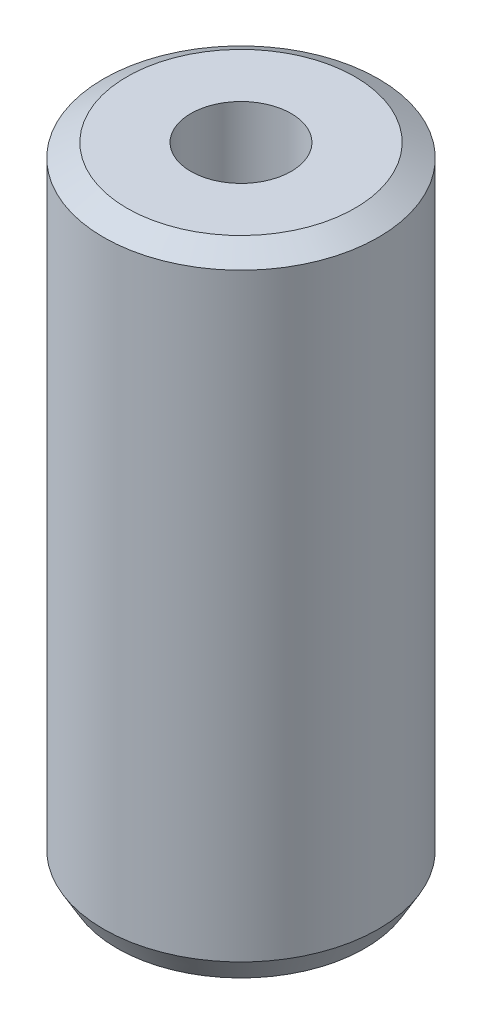
ISO-10303-21;
HEADER;
FILE_DESCRIPTION(('STEP AP214'),'2;1');
FILE_NAME('part.step','',(''),(''),'','','');
FILE_SCHEMA(('AUTOMOTIVE_DESIGN { 1 0 10303 214 1 1 1 1 }'));
ENDSEC;
DATA;
#1=APPLICATION_CONTEXT('core data for automotive mechanical design processes');
#2=APPLICATION_PROTOCOL_DEFINITION('international standard','automotive_design',2000,#1);
#3=PRODUCT_CONTEXT('',#1,'mechanical');
#4=PRODUCT('Part','Part','',(#3));
#5=PRODUCT_RELATED_PRODUCT_CATEGORY('part','',(#4));
#6=PRODUCT_DEFINITION_FORMATION('','',#4);
#7=PRODUCT_DEFINITION_CONTEXT('part definition',#1,'design');
#8=PRODUCT_DEFINITION('design','',#6,#7);
#9=PRODUCT_DEFINITION_SHAPE('','',#8);
#10=(LENGTH_UNIT() NAMED_UNIT(*) SI_UNIT(.MILLI.,.METRE.));
#11=(NAMED_UNIT(*) PLANE_ANGLE_UNIT() SI_UNIT($,.RADIAN.));
#12=(NAMED_UNIT(*) SI_UNIT($,.STERADIAN.) SOLID_ANGLE_UNIT());
#13=UNCERTAINTY_MEASURE_WITH_UNIT(LENGTH_MEASURE(1.E-05),#10,'distance_accuracy_value','');
#14=(GEOMETRIC_REPRESENTATION_CONTEXT(3) GLOBAL_UNCERTAINTY_ASSIGNED_CONTEXT((#13)) GLOBAL_UNIT_ASSIGNED_CONTEXT((#10,
#11,#12)) REPRESENTATION_CONTEXT('',''));
#15=CARTESIAN_POINT('',(0.,0.,0.));
#16=DIRECTION('',(0.,0.,1.));
#17=DIRECTION('',(1.,0.,0.));
#18=AXIS2_PLACEMENT_3D('',#15,#16,#17);
#19=CARTESIAN_POINT('',(0.,92.5859784305405,0.));
#20=DIRECTION('',(0.,-1.,0.));
#21=DIRECTION('',(0.,0.,-1.));
#22=AXIS2_PLACEMENT_3D('',#19,#20,#21);
#23=CYLINDRICAL_SURFACE('',#22,20.);
#24=CARTESIAN_POINT('',(0.,90.6188255247829,0.));
#25=DIRECTION('',(0.,1.,0.));
#26=DIRECTION('',(0.,0.,1.));
#27=AXIS2_PLACEMENT_3D('',#24,#25,#26);
#28=CIRCLE('',#27,20.);
#29=CARTESIAN_POINT('',(0.,90.6188255247829,20.));
#30=VERTEX_POINT('',#29);
#31=EDGE_CURVE('E50',#30,#30,#28,.F.);
#32=ORIENTED_EDGE('',*,*,#31,.T.);
#33=EDGE_LOOP('',(#32));
#34=FACE_BOUND('',#33,.T.);
#35=CARTESIAN_POINT('',(0.,3.40720877902879,0.));
#36=DIRECTION('',(0.,1.,0.));
#37=DIRECTION('',(0.,0.,1.));
#38=AXIS2_PLACEMENT_3D('',#35,#36,#37);
#39=CIRCLE('',#38,20.);
#40=CARTESIAN_POINT('',(0.,3.40720877902879,20.));
#41=VERTEX_POINT('',#40);
#42=EDGE_CURVE('E51',#41,#41,#39,.T.);
#43=ORIENTED_EDGE('',*,*,#42,.T.);
#44=EDGE_LOOP('',(#43));
#45=FACE_BOUND('',#44,.T.);
#46=ADVANCED_FACE('F39',(#34,#45),#23,.T.);
#47=CARTESIAN_POINT('',(0.,92.5859784305405,0.));
#48=DIRECTION('',(0.,1.,0.));
#49=DIRECTION('',(0.,0.,1.));
#50=AXIS2_PLACEMENT_3D('',#47,#48,#49);
#51=PLANE('',#50);
#52=CARTESIAN_POINT('',(0.,92.5859784305405,0.));
#53=DIRECTION('',(0.,1.,0.));
#54=DIRECTION('',(0.,0.,1.));
#55=AXIS2_PLACEMENT_3D('',#52,#53,#54);
#56=CIRCLE('',#55,16.5927912209712);
#57=CARTESIAN_POINT('',(0.,92.5859784305405,16.5927912209712));
#58=VERTEX_POINT('',#57);
#59=EDGE_CURVE('E54',#58,#58,#56,.T.);
#60=ORIENTED_EDGE('',*,*,#59,.T.);
#61=EDGE_LOOP('',(#60));
#62=FACE_BOUND('',#61,.T.);
#63=CARTESIAN_POINT('',(0.,92.5859784305405,0.));
#64=DIRECTION('',(0.,1.,0.));
#65=DIRECTION('',(0.,0.,1.));
#66=AXIS2_PLACEMENT_3D('',#63,#64,#65);
#67=CIRCLE('',#66,7.30747768870246);
#68=CARTESIAN_POINT('',(0.,92.5859784305405,7.30747768870246));
#69=VERTEX_POINT('',#68);
#70=EDGE_CURVE('E58',#69,#69,#67,.T.);
#71=ORIENTED_EDGE('',*,*,#70,.F.);
#72=EDGE_LOOP('',(#71));
#73=FACE_BOUND('',#72,.T.);
#74=ADVANCED_FACE('F69',(#62,#73),#51,.T.);
#75=CARTESIAN_POINT('',(0.,0.,0.));
#76=DIRECTION('',(0.,1.,0.));
#77=DIRECTION('',(0.,0.,1.));
#78=AXIS2_PLACEMENT_3D('',#75,#76,#77);
#79=PLANE('',#78);
#80=CARTESIAN_POINT('',(0.,0.,0.));
#81=DIRECTION('',(0.,1.,0.));
#82=DIRECTION('',(0.,0.,1.));
#83=AXIS2_PLACEMENT_3D('',#80,#81,#82);
#84=CIRCLE('',#83,18.0328470942425);
#85=CARTESIAN_POINT('',(0.,0.,18.0328470942425));
#86=VERTEX_POINT('',#85);
#87=EDGE_CURVE('E10',#86,#86,#84,.F.);
#88=ORIENTED_EDGE('',*,*,#87,.T.);
#89=EDGE_LOOP('',(#88));
#90=FACE_BOUND('',#89,.T.);
#91=CARTESIAN_POINT('',(0.,0.,0.));
#92=DIRECTION('',(0.,1.,0.));
#93=DIRECTION('',(0.,0.,1.));
#94=AXIS2_PLACEMENT_3D('',#91,#92,#93);
#95=CIRCLE('',#94,7.30747768870246);
#96=CARTESIAN_POINT('',(0.,0.,7.30747768870246));
#97=VERTEX_POINT('',#96);
#98=EDGE_CURVE('E63',#97,#97,#95,.T.);
#99=ORIENTED_EDGE('',*,*,#98,.T.);
#100=EDGE_LOOP('',(#99));
#101=FACE_BOUND('',#100,.T.);
#102=ADVANCED_FACE('F75',(#90,#101),#79,.F.);
#103=CARTESIAN_POINT('',(0.,92.5859784305405,0.));
#104=DIRECTION('',(0.,-1.,0.));
#105=DIRECTION('',(0.,0.,-1.));
#106=AXIS2_PLACEMENT_3D('',#103,#104,#105);
#107=CYLINDRICAL_SURFACE('',#106,7.30747768870246);
#108=ORIENTED_EDGE('',*,*,#70,.T.);
#109=EDGE_LOOP('',(#108));
#110=FACE_BOUND('',#109,.T.);
#111=ORIENTED_EDGE('',*,*,#98,.F.);
#112=EDGE_LOOP('',(#111));
#113=FACE_BOUND('',#112,.T.);
#114=ADVANCED_FACE('F70',(#110,#113),#107,.F.);
#115=CARTESIAN_POINT('',(0.,92.5859784305405,0.));
#116=DIRECTION('',(0.,-1.,0.));
#117=DIRECTION('',(0.,0.,-1.));
#118=AXIS2_PLACEMENT_3D('',#115,#116,#117);
#119=CONICAL_SURFACE('',#118,16.5927912209712,1.04719755119659);
#120=ORIENTED_EDGE('',*,*,#31,.F.);
#121=EDGE_LOOP('',(#120));
#122=FACE_BOUND('',#121,.T.);
#123=ORIENTED_EDGE('',*,*,#59,.F.);
#124=EDGE_LOOP('',(#123));
#125=FACE_BOUND('',#124,.T.);
#126=ADVANCED_FACE('F81',(#122,#125),#119,.T.);
#127=CARTESIAN_POINT('',(0.,3.40720877902879,0.));
#128=DIRECTION('',(0.,1.,0.));
#129=DIRECTION('',(0.,0.,1.));
#130=AXIS2_PLACEMENT_3D('',#127,#128,#129);
#131=CONICAL_SURFACE('',#130,20.,0.523598775598301);
#132=CARTESIAN_POINT('',(0.,0.,18.0328470942425));
#133=CARTESIAN_POINT('',(0.,0.0354917581148829,18.0533382703441));
#134=CARTESIAN_POINT('',(0.,0.0709835162297661,18.0738294464457));
#135=CARTESIAN_POINT('',(0.,0.141967032459533,18.114811798649));
#136=CARTESIAN_POINT('',(0.,0.177458790574416,18.1353029747507));
#137=CARTESIAN_POINT('',(0.,0.248442306804183,18.1762853269539));
#138=CARTESIAN_POINT('',(0.,0.283934064919066,18.1967765030556));
#139=CARTESIAN_POINT('',(0.,0.354917581148832,18.2377588552589));
#140=CARTESIAN_POINT('',(0.,0.390409339263715,18.2582500313605));
#141=CARTESIAN_POINT('',(0.,0.461392855493482,18.2992323835638));
#142=CARTESIAN_POINT('',(0.,0.496884613608366,18.3197235596654));
#143=CARTESIAN_POINT('',(0.,0.567868129838132,18.3607059118687));
#144=CARTESIAN_POINT('',(0.,0.603359887953015,18.3811970879704));
#145=CARTESIAN_POINT('',(0.,0.674343404182782,18.4221794401736));
#146=CARTESIAN_POINT('',(0.,0.709835162297665,18.4426706162753));
#147=CARTESIAN_POINT('',(0.,0.780818678527432,18.4836529684786));
#148=CARTESIAN_POINT('',(0.,0.816310436642315,18.5041441445802));
#149=CARTESIAN_POINT('',(0.,0.887293952872082,18.5451264967835));
#150=CARTESIAN_POINT('',(0.,0.922785710986965,18.5656176728851));
#151=CARTESIAN_POINT('',(0.,0.993769227216732,18.6066000250884));
#152=CARTESIAN_POINT('',(0.,1.02926098533161,18.62709120119));
#153=CARTESIAN_POINT('',(0.,1.10024450156138,18.6680735533933));
#154=CARTESIAN_POINT('',(0.,1.13573625967626,18.688564729495));
#155=CARTESIAN_POINT('',(0.,1.20671977590603,18.7295470816983));
#156=CARTESIAN_POINT('',(0.,1.24221153402091,18.7500382577999));
#157=CARTESIAN_POINT('',(0.,1.31319505025068,18.7910206100032));
#158=CARTESIAN_POINT('',(0.,1.34868680836556,18.8115117861048));
#159=CARTESIAN_POINT('',(0.,1.41967032459533,18.8524941383081));
#160=CARTESIAN_POINT('',(0.,1.45516208271021,18.8729853144097));
#161=CARTESIAN_POINT('',(0.,1.52614559893998,18.913967666613));
#162=CARTESIAN_POINT('',(0.,1.56163735705486,18.9344588427147));
#163=CARTESIAN_POINT('',(0.,1.63262087328463,18.9754411949179));
#164=CARTESIAN_POINT('',(0.,1.66811263139951,18.9959323710196));
#165=CARTESIAN_POINT('',(0.,1.73909614762928,19.0369147232229));
#166=CARTESIAN_POINT('',(0.,1.77458790574416,19.0574058993245));
#167=CARTESIAN_POINT('',(0.,1.84557142197393,19.0983882515278));
#168=CARTESIAN_POINT('',(0.,1.88106318008881,19.1188794276294));
#169=CARTESIAN_POINT('',(0.,1.95204669631858,19.1598617798327));
#170=CARTESIAN_POINT('',(0.,1.98753845443346,19.1803529559344));
#171=CARTESIAN_POINT('',(0.,2.05852197066323,19.2213353081376));
#172=CARTESIAN_POINT('',(0.,2.09401372877811,19.2418264842393));
#173=CARTESIAN_POINT('',(0.,2.16499724500788,19.2828088364426));
#174=CARTESIAN_POINT('',(0.,2.20048900312276,19.3033000125442));
#175=CARTESIAN_POINT('',(0.,2.27147251935253,19.3442823647475));
#176=CARTESIAN_POINT('',(0.,2.30696427746741,19.3647735408491));
#177=CARTESIAN_POINT('',(0.,2.37794779369718,19.4057558930524));
#178=CARTESIAN_POINT('',(0.,2.41343955181206,19.4262470691541));
#179=CARTESIAN_POINT('',(0.,2.48442306804183,19.4672294213573));
#180=CARTESIAN_POINT('',(0.,2.51991482615671,19.487720597459));
#181=CARTESIAN_POINT('',(0.,2.59089834238648,19.5287029496623));
#182=CARTESIAN_POINT('',(0.,2.62639010050136,19.5491941257639));
#183=CARTESIAN_POINT('',(0.,2.69737361673113,19.5901764779672));
#184=CARTESIAN_POINT('',(0.,2.73286537484601,19.6106676540688));
#185=CARTESIAN_POINT('',(0.,2.80384889107578,19.6516500062721));
#186=CARTESIAN_POINT('',(0.,2.83934064919066,19.6721411823737));
#187=CARTESIAN_POINT('',(0.,2.91032416542043,19.713123534577));
#188=CARTESIAN_POINT('',(0.,2.94581592353531,19.7336147106787));
#189=CARTESIAN_POINT('',(0.,3.01679943976508,19.7745970628819));
#190=CARTESIAN_POINT('',(0.,3.05229119787996,19.7950882389836));
#191=CARTESIAN_POINT('',(0.,3.12327471410973,19.8360705911869));
#192=CARTESIAN_POINT('',(0.,3.15876647222461,19.8565617672885));
#193=CARTESIAN_POINT('',(0.,3.22974998845438,19.8975441194918));
#194=CARTESIAN_POINT('',(0.,3.26524174656926,19.9180352955934));
#195=CARTESIAN_POINT('',(0.,3.33622526279903,19.9590176477967));
#196=CARTESIAN_POINT('',(0.,3.37171702091391,19.9795088238984));
#197=CARTESIAN_POINT('',(0.,3.40720877902879,20.));
#198=B_SPLINE_CURVE_WITH_KNOTS('',3,(#132,#133,#134,#135,#136,#137,#138,#139,#140,#141,#142,
#143,#144,#145,#146,#147,#148,#149,#150,#151,#152,#153,#154,#155,#156,#157,#158,#159,#160,#161,
#162,#163,#164,#165,#166,#167,#168,#169,#170,#171,#172,#173,#174,#175,#176,#177,#178,#179,#180,
#181,#182,#183,#184,#185,#186,#187,#188,#189,#190,#191,#192,#193,#194,#195,#196,#197),
.UNSPECIFIED.,.F.,.F.,(4,2,2,2,2,2,2,2,2,2,2,2,2,2,2,2,2,2,2,2,2,2,2,2,2,2,2,2,2,2,2,2,4),(0.,
0.122947056609846,0.245894113219692,0.368841169829538,0.491788226439384,0.614735283049228,
0.737682339659074,0.860629396268921,0.983576452878766,1.10652350948861,1.22947056609846,
1.3524176227083,1.47536467931815,1.598311735928,1.72125879253784,1.84420584914769,
1.96715290575753,2.09009996236738,2.21304701897722,2.33599407558707,2.45894113219692,
2.58188818880676,2.70483524541661,2.82778230202645,2.9507293586363,3.07367641524615,
3.19662347185599,3.31957052846584,3.44251758507568,3.56546464168553,3.68841169829538,
3.81135875490522,3.93430581151507),.UNSPECIFIED.);
#199=EDGE_CURVE('BSEAM45',#86,#41,#198,.T.);
#200=ORIENTED_EDGE('',*,*,#87,.F.);
#201=ORIENTED_EDGE('',*,*,#42,.F.);
#202=ORIENTED_EDGE('',*,*,#199,.T.);
#203=ORIENTED_EDGE('',*,*,#199,.F.);
#204=EDGE_LOOP('',(#200,#202,#201,#203));
#205=FACE_BOUND('',#204,.T.);
#206=ADVANCED_FACE('F45',(#205),#131,.T.);
#207=CLOSED_SHELL('',(#46,#74,#102,#114,#126,#206));
#208=MANIFOLD_SOLID_BREP('B2',#207);
#209=ADVANCED_BREP_SHAPE_REPRESENTATION('',(#18,#208),#14);
#210=SHAPE_DEFINITION_REPRESENTATION(#9,#209);
ENDSEC;
END-ISO-10303-21;
